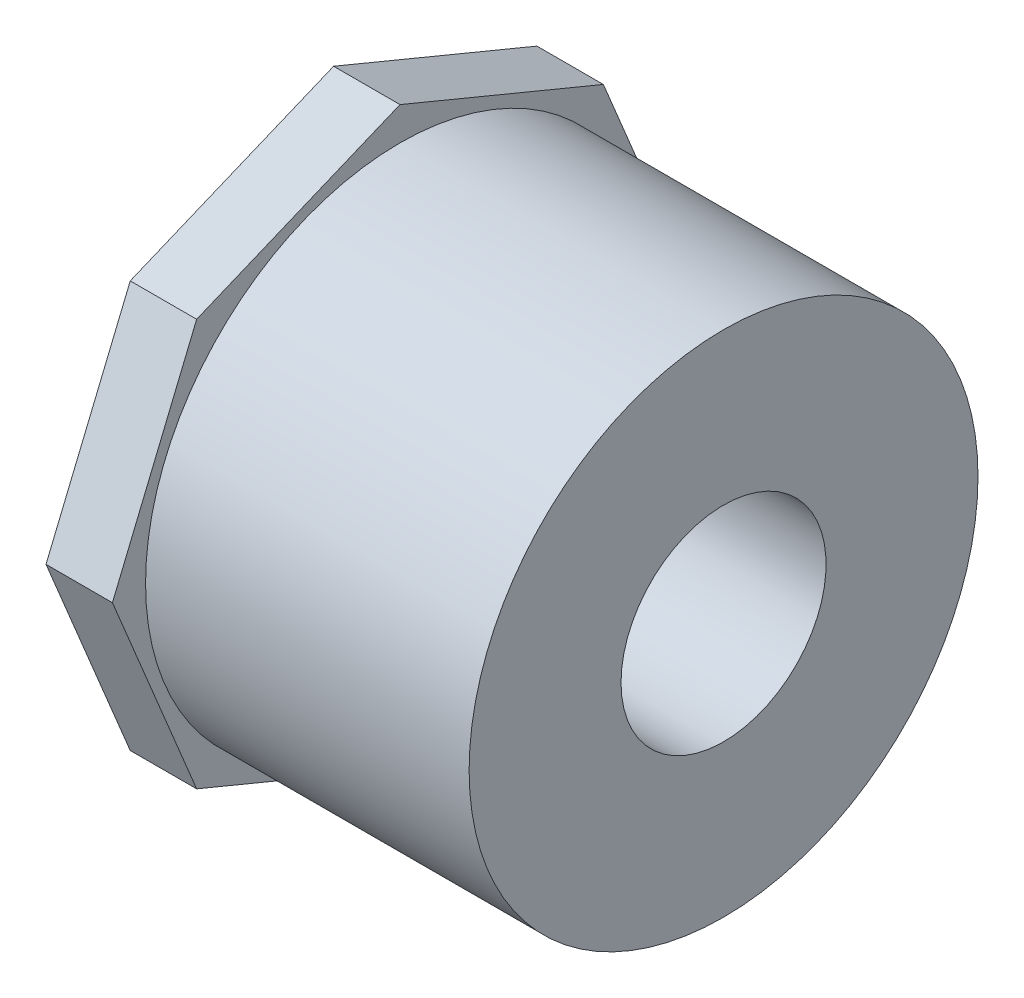
ISO-10303-21;
HEADER;
FILE_DESCRIPTION(('STEP AP214'),'2;1');
FILE_NAME('part.step','',(''),(''),'','','');
FILE_SCHEMA(('AUTOMOTIVE_DESIGN { 1 0 10303 214 1 1 1 1 }'));
ENDSEC;
DATA;
#1=APPLICATION_CONTEXT('core data for automotive mechanical design processes');
#2=APPLICATION_PROTOCOL_DEFINITION('international standard','automotive_design',2000,#1);
#3=PRODUCT_CONTEXT('',#1,'mechanical');
#4=PRODUCT('Part','Part','',(#3));
#5=PRODUCT_RELATED_PRODUCT_CATEGORY('part','',(#4));
#6=PRODUCT_DEFINITION_FORMATION('','',#4);
#7=PRODUCT_DEFINITION_CONTEXT('part definition',#1,'design');
#8=PRODUCT_DEFINITION('design','',#6,#7);
#9=PRODUCT_DEFINITION_SHAPE('','',#8);
#10=(LENGTH_UNIT() NAMED_UNIT(*) SI_UNIT(.MILLI.,.METRE.));
#11=(NAMED_UNIT(*) PLANE_ANGLE_UNIT() SI_UNIT($,.RADIAN.));
#12=(NAMED_UNIT(*) SI_UNIT($,.STERADIAN.) SOLID_ANGLE_UNIT());
#13=UNCERTAINTY_MEASURE_WITH_UNIT(LENGTH_MEASURE(1.E-05),#10,'distance_accuracy_value','');
#14=(GEOMETRIC_REPRESENTATION_CONTEXT(3) GLOBAL_UNCERTAINTY_ASSIGNED_CONTEXT((#13)) GLOBAL_UNIT_ASSIGNED_CONTEXT((#10,
#11,#12)) REPRESENTATION_CONTEXT('',''));
#15=CARTESIAN_POINT('',(0.,0.,0.));
#16=DIRECTION('',(0.,0.,1.));
#17=DIRECTION('',(1.,0.,0.));
#18=AXIS2_PLACEMENT_3D('',#15,#16,#17);
#19=CARTESIAN_POINT('',(-46.228,0.,0.));
#20=DIRECTION('',(-1.,0.,0.));
#21=DIRECTION('',(0.,0.,1.));
#22=AXIS2_PLACEMENT_3D('',#19,#20,#21);
#23=CYLINDRICAL_SURFACE('',#22,30.1625);
#24=CARTESIAN_POINT('',(0.,0.,0.));
#25=DIRECTION('',(-1.,0.,0.));
#26=DIRECTION('',(0.,0.,1.));
#27=AXIS2_PLACEMENT_3D('',#24,#25,#26);
#28=CIRCLE('',#27,30.1625);
#29=CARTESIAN_POINT('',(0.,0.,30.1625));
#30=VERTEX_POINT('',#29);
#31=EDGE_CURVE('E167',#30,#30,#28,.T.);
#32=ORIENTED_EDGE('',*,*,#31,.T.);
#33=EDGE_LOOP('',(#32));
#34=FACE_BOUND('',#33,.T.);
#35=CARTESIAN_POINT('',(-38.354,0.,0.));
#36=DIRECTION('',(-1.,0.,0.));
#37=DIRECTION('',(0.,0.,1.));
#38=AXIS2_PLACEMENT_3D('',#35,#36,#37);
#39=CIRCLE('',#38,30.1625);
#40=CARTESIAN_POINT('',(-38.354,0.,30.1625));
#41=VERTEX_POINT('',#40);
#42=EDGE_CURVE('E38',#41,#41,#39,.F.);
#43=ORIENTED_EDGE('',*,*,#42,.T.);
#44=EDGE_LOOP('',(#43));
#45=FACE_BOUND('',#44,.T.);
#46=ADVANCED_FACE('F34',(#34,#45),#23,.T.);
#47=CARTESIAN_POINT('',(-46.228,-30.1625,0.));
#48=DIRECTION('',(-1.,0.,0.));
#49=DIRECTION('',(0.,0.,1.));
#50=AXIS2_PLACEMENT_3D('',#47,#48,#49);
#51=PLANE('',#50);
#52=CARTESIAN_POINT('',(-46.228,0.,0.));
#53=DIRECTION('',(-1.,0.,0.));
#54=DIRECTION('',(0.,0.,1.));
#55=AXIS2_PLACEMENT_3D('',#52,#53,#54);
#56=CIRCLE('',#55,16.8275);
#57=CARTESIAN_POINT('',(-46.228,0.,16.8275));
#58=VERTEX_POINT('',#57);
#59=EDGE_CURVE('E11',#58,#58,#56,.T.);
#60=ORIENTED_EDGE('',*,*,#59,.F.);
#61=EDGE_LOOP('',(#60));
#62=FACE_BOUND('',#61,.T.);
#63=DIRECTION('',(0.,0.38268343236509,-0.923879532511287));
#64=VECTOR('',#63,1.);
#65=CARTESIAN_POINT('',(-46.228,24.1059947715417,24.1059947715417));
#66=LINE('',#65,#64);
#67=CARTESIAN_POINT('',(-46.228,24.1059947715417,24.1059947715417));
#68=VERTEX_POINT('',#67);
#69=CARTESIAN_POINT('',(-46.228,34.0910247404092,0.));
#70=VERTEX_POINT('',#69);
#71=EDGE_CURVE('E135',#68,#70,#66,.T.);
#72=ORIENTED_EDGE('',*,*,#71,.T.);
#73=DIRECTION('',(0.,-0.38268343236509,-0.923879532511287));
#74=VECTOR('',#73,1.);
#75=CARTESIAN_POINT('',(-46.228,34.0910247404092,0.));
#76=LINE('',#75,#74);
#77=CARTESIAN_POINT('',(-46.228,24.1059947715417,-24.1059947715417));
#78=VERTEX_POINT('',#77);
#79=EDGE_CURVE('E138',#70,#78,#76,.T.);
#80=ORIENTED_EDGE('',*,*,#79,.T.);
#81=DIRECTION('',(0.,-0.923879532511287,-0.38268343236509));
#82=VECTOR('',#81,1.);
#83=CARTESIAN_POINT('',(-46.228,24.1059947715417,-24.1059947715417));
#84=LINE('',#83,#82);
#85=CARTESIAN_POINT('',(-46.228,0.,-34.0910247404092));
#86=VERTEX_POINT('',#85);
#87=EDGE_CURVE('E141',#78,#86,#84,.T.);
#88=ORIENTED_EDGE('',*,*,#87,.T.);
#89=DIRECTION('',(0.,-0.923879532511287,0.382683432365089));
#90=VECTOR('',#89,1.);
#91=CARTESIAN_POINT('',(-46.228,0.,-34.0910247404092));
#92=LINE('',#91,#90);
#93=CARTESIAN_POINT('',(-46.228,-24.1059947715417,-24.1059947715417));
#94=VERTEX_POINT('',#93);
#95=EDGE_CURVE('E144',#86,#94,#92,.T.);
#96=ORIENTED_EDGE('',*,*,#95,.T.);
#97=DIRECTION('',(0.,-0.38268343236509,0.923879532511287));
#98=VECTOR('',#97,1.);
#99=CARTESIAN_POINT('',(-46.228,-24.1059947715417,-24.1059947715417));
#100=LINE('',#99,#98);
#101=CARTESIAN_POINT('',(-46.228,-34.0910247404092,0.));
#102=VERTEX_POINT('',#101);
#103=EDGE_CURVE('E147',#94,#102,#100,.T.);
#104=ORIENTED_EDGE('',*,*,#103,.T.);
#105=DIRECTION('',(0.,0.38268343236509,0.923879532511287));
#106=VECTOR('',#105,1.);
#107=CARTESIAN_POINT('',(-46.228,-34.0910247404092,0.));
#108=LINE('',#107,#106);
#109=CARTESIAN_POINT('',(-46.228,-24.1059947715417,24.1059947715417));
#110=VERTEX_POINT('',#109);
#111=EDGE_CURVE('E150',#102,#110,#108,.T.);
#112=ORIENTED_EDGE('',*,*,#111,.T.);
#113=DIRECTION('',(0.,0.923879532511287,0.38268343236509));
#114=VECTOR('',#113,1.);
#115=CARTESIAN_POINT('',(-46.228,-24.1059947715417,24.1059947715417));
#116=LINE('',#115,#114);
#117=CARTESIAN_POINT('',(-46.228,0.,34.0910247404092));
#118=VERTEX_POINT('',#117);
#119=EDGE_CURVE('E112',#110,#118,#116,.T.);
#120=ORIENTED_EDGE('',*,*,#119,.T.);
#121=DIRECTION('',(0.,0.923879532511287,-0.38268343236509));
#122=VECTOR('',#121,1.);
#123=CARTESIAN_POINT('',(-46.228,0.,34.0910247404092));
#124=LINE('',#123,#122);
#125=EDGE_CURVE('E153',#118,#68,#124,.T.);
#126=ORIENTED_EDGE('',*,*,#125,.T.);
#127=EDGE_LOOP('',(#72,#80,#88,#96,#104,#112,#120,#126));
#128=FACE_BOUND('',#127,.T.);
#129=ADVANCED_FACE('F36',(#62,#128),#51,.T.);
#130=CARTESIAN_POINT('',(-17.78,0.,0.));
#131=DIRECTION('',(-1.,0.,0.));
#132=DIRECTION('',(0.,0.,1.));
#133=AXIS2_PLACEMENT_3D('',#130,#131,#132);
#134=CONICAL_SURFACE('',#133,16.637,0.00669632848002419);
#135=ORIENTED_EDGE('',*,*,#59,.T.);
#136=EDGE_LOOP('',(#135));
#137=FACE_BOUND('',#136,.T.);
#138=CARTESIAN_POINT('',(-17.78,0.,0.));
#139=DIRECTION('',(-1.,0.,0.));
#140=DIRECTION('',(0.,0.,1.));
#141=AXIS2_PLACEMENT_3D('',#138,#139,#140);
#142=CIRCLE('',#141,16.637);
#143=CARTESIAN_POINT('',(-17.78,0.,16.637));
#144=VERTEX_POINT('',#143);
#145=EDGE_CURVE('E44',#144,#144,#142,.T.);
#146=ORIENTED_EDGE('',*,*,#145,.F.);
#147=EDGE_LOOP('',(#146));
#148=FACE_BOUND('',#147,.T.);
#149=ADVANCED_FACE('F182',(#137,#148),#134,.F.);
#150=CARTESIAN_POINT('',(-17.78,-12.1539,0.));
#151=DIRECTION('',(-1.,0.,0.));
#152=DIRECTION('',(0.,0.,1.));
#153=AXIS2_PLACEMENT_3D('',#150,#151,#152);
#154=PLANE('',#153);
#155=ORIENTED_EDGE('',*,*,#145,.T.);
#156=EDGE_LOOP('',(#155));
#157=FACE_BOUND('',#156,.T.);
#158=CARTESIAN_POINT('',(-17.78,0.,0.));
#159=DIRECTION('',(-1.,0.,0.));
#160=DIRECTION('',(0.,0.,1.));
#161=AXIS2_PLACEMENT_3D('',#158,#159,#160);
#162=CIRCLE('',#161,12.1539);
#163=CARTESIAN_POINT('',(-17.78,0.,12.1539));
#164=VERTEX_POINT('',#163);
#165=EDGE_CURVE('E173',#164,#164,#162,.T.);
#166=ORIENTED_EDGE('',*,*,#165,.F.);
#167=EDGE_LOOP('',(#166));
#168=FACE_BOUND('',#167,.T.);
#169=ADVANCED_FACE('F179',(#157,#168),#154,.T.);
#170=CARTESIAN_POINT('',(-46.228,0.,0.));
#171=DIRECTION('',(-1.,0.,0.));
#172=DIRECTION('',(0.,0.,1.));
#173=AXIS2_PLACEMENT_3D('',#170,#171,#172);
#174=CYLINDRICAL_SURFACE('',#173,12.1539);
#175=ORIENTED_EDGE('',*,*,#165,.T.);
#176=EDGE_LOOP('',(#175));
#177=FACE_BOUND('',#176,.T.);
#178=CARTESIAN_POINT('',(0.,0.,0.));
#179=DIRECTION('',(-1.,0.,0.));
#180=DIRECTION('',(0.,0.,1.));
#181=AXIS2_PLACEMENT_3D('',#178,#179,#180);
#182=CIRCLE('',#181,12.1539);
#183=CARTESIAN_POINT('',(0.,0.,12.1539));
#184=VERTEX_POINT('',#183);
#185=EDGE_CURVE('E170',#184,#184,#182,.T.);
#186=ORIENTED_EDGE('',*,*,#185,.F.);
#187=EDGE_LOOP('',(#186));
#188=FACE_BOUND('',#187,.T.);
#189=ADVANCED_FACE('F189',(#177,#188),#174,.F.);
#190=CARTESIAN_POINT('',(0.,-12.1539,0.));
#191=DIRECTION('',(1.,0.,0.));
#192=DIRECTION('',(0.,0.,-1.));
#193=AXIS2_PLACEMENT_3D('',#190,#191,#192);
#194=PLANE('',#193);
#195=ORIENTED_EDGE('',*,*,#185,.T.);
#196=EDGE_LOOP('',(#195));
#197=FACE_BOUND('',#196,.T.);
#198=ORIENTED_EDGE('',*,*,#31,.F.);
#199=EDGE_LOOP('',(#198));
#200=FACE_BOUND('',#199,.T.);
#201=ADVANCED_FACE('F202',(#197,#200),#194,.T.);
#202=CARTESIAN_POINT('',(-38.354,24.1059947715417,24.1059947715417));
#203=DIRECTION('',(0.,0.923879532511287,0.38268343236509));
#204=DIRECTION('',(0.,-0.38268343236509,0.923879532511287));
#205=AXIS2_PLACEMENT_3D('',#202,#203,#204);
#206=PLANE('',#205);
#207=ORIENTED_EDGE('',*,*,#71,.F.);
#208=DIRECTION('',(-1.,0.,0.));
#209=VECTOR('',#208,1.);
#210=CARTESIAN_POINT('',(-38.354,24.1059947715417,24.1059947715417));
#211=LINE('',#210,#209);
#212=CARTESIAN_POINT('',(-38.354,24.1059947715417,24.1059947715417));
#213=VERTEX_POINT('',#212);
#214=EDGE_CURVE('E52',#213,#68,#211,.T.);
#215=ORIENTED_EDGE('',*,*,#214,.F.);
#216=DIRECTION('',(0.,0.38268343236509,-0.923879532511287));
#217=VECTOR('',#216,1.);
#218=CARTESIAN_POINT('',(-38.354,24.1059947715417,24.1059947715417));
#219=LINE('',#218,#217);
#220=CARTESIAN_POINT('',(-38.354,34.0910247404092,0.));
#221=VERTEX_POINT('',#220);
#222=EDGE_CURVE('E156',#213,#221,#219,.T.);
#223=ORIENTED_EDGE('',*,*,#222,.T.);
#224=DIRECTION('',(-1.,0.,0.));
#225=VECTOR('',#224,1.);
#226=CARTESIAN_POINT('',(-38.354,34.0910247404092,0.));
#227=LINE('',#226,#225);
#228=EDGE_CURVE('E93',#221,#70,#227,.T.);
#229=ORIENTED_EDGE('',*,*,#228,.T.);
#230=EDGE_LOOP('',(#207,#215,#223,#229));
#231=FACE_BOUND('',#230,.T.);
#232=ADVANCED_FACE('F200',(#231),#206,.T.);
#233=CARTESIAN_POINT('',(-38.354,0.,34.0910247404092));
#234=DIRECTION('',(0.,0.38268343236509,0.923879532511287));
#235=DIRECTION('',(0.,-0.923879532511287,0.38268343236509));
#236=AXIS2_PLACEMENT_3D('',#233,#234,#235);
#237=PLANE('',#236);
#238=ORIENTED_EDGE('',*,*,#125,.F.);
#239=DIRECTION('',(-1.,0.,0.));
#240=VECTOR('',#239,1.);
#241=CARTESIAN_POINT('',(-38.354,0.,34.0910247404092));
#242=LINE('',#241,#240);
#243=CARTESIAN_POINT('',(-38.354,0.,34.0910247404092));
#244=VERTEX_POINT('',#243);
#245=EDGE_CURVE('E81',#244,#118,#242,.T.);
#246=ORIENTED_EDGE('',*,*,#245,.F.);
#247=DIRECTION('',(0.,0.923879532511287,-0.38268343236509));
#248=VECTOR('',#247,1.);
#249=CARTESIAN_POINT('',(-38.354,0.,34.0910247404092));
#250=LINE('',#249,#248);
#251=EDGE_CURVE('E125',#244,#213,#250,.T.);
#252=ORIENTED_EDGE('',*,*,#251,.T.);
#253=ORIENTED_EDGE('',*,*,#214,.T.);
#254=EDGE_LOOP('',(#238,#246,#252,#253));
#255=FACE_BOUND('',#254,.T.);
#256=ADVANCED_FACE('F227',(#255),#237,.T.);
#257=CARTESIAN_POINT('',(-38.354,-24.1059947715417,24.1059947715417));
#258=DIRECTION('',(0.,-0.38268343236509,0.923879532511287));
#259=DIRECTION('',(0.,-0.923879532511287,-0.38268343236509));
#260=AXIS2_PLACEMENT_3D('',#257,#258,#259);
#261=PLANE('',#260);
#262=ORIENTED_EDGE('',*,*,#119,.F.);
#263=DIRECTION('',(-1.,0.,0.));
#264=VECTOR('',#263,1.);
#265=CARTESIAN_POINT('',(-38.354,-24.1059947715417,24.1059947715417));
#266=LINE('',#265,#264);
#267=CARTESIAN_POINT('',(-38.354,-24.1059947715417,24.1059947715417));
#268=VERTEX_POINT('',#267);
#269=EDGE_CURVE('E107',#268,#110,#266,.T.);
#270=ORIENTED_EDGE('',*,*,#269,.F.);
#271=DIRECTION('',(0.,0.923879532511287,0.38268343236509));
#272=VECTOR('',#271,1.);
#273=CARTESIAN_POINT('',(-38.354,-24.1059947715417,24.1059947715417));
#274=LINE('',#273,#272);
#275=EDGE_CURVE('E110',#268,#244,#274,.T.);
#276=ORIENTED_EDGE('',*,*,#275,.T.);
#277=ORIENTED_EDGE('',*,*,#245,.T.);
#278=EDGE_LOOP('',(#262,#270,#276,#277));
#279=FACE_BOUND('',#278,.T.);
#280=ADVANCED_FACE('F109',(#279),#261,.T.);
#281=CARTESIAN_POINT('',(-38.354,-34.0910247404092,0.));
#282=DIRECTION('',(0.,-0.923879532511287,0.38268343236509));
#283=DIRECTION('',(0.,-0.38268343236509,-0.923879532511287));
#284=AXIS2_PLACEMENT_3D('',#281,#282,#283);
#285=PLANE('',#284);
#286=ORIENTED_EDGE('',*,*,#111,.F.);
#287=DIRECTION('',(-1.,0.,0.));
#288=VECTOR('',#287,1.);
#289=CARTESIAN_POINT('',(-38.354,-34.0910247404092,0.));
#290=LINE('',#289,#288);
#291=CARTESIAN_POINT('',(-38.354,-34.0910247404092,0.));
#292=VERTEX_POINT('',#291);
#293=EDGE_CURVE('E117',#292,#102,#290,.T.);
#294=ORIENTED_EDGE('',*,*,#293,.F.);
#295=DIRECTION('',(0.,0.38268343236509,0.923879532511287));
#296=VECTOR('',#295,1.);
#297=CARTESIAN_POINT('',(-38.354,-34.0910247404092,0.));
#298=LINE('',#297,#296);
#299=EDGE_CURVE('E123',#292,#268,#298,.T.);
#300=ORIENTED_EDGE('',*,*,#299,.T.);
#301=ORIENTED_EDGE('',*,*,#269,.T.);
#302=EDGE_LOOP('',(#286,#294,#300,#301));
#303=FACE_BOUND('',#302,.T.);
#304=ADVANCED_FACE('F127',(#303),#285,.T.);
#305=CARTESIAN_POINT('',(-38.354,-24.1059947715417,-24.1059947715417));
#306=DIRECTION('',(0.,-0.923879532511287,-0.38268343236509));
#307=DIRECTION('',(0.,0.38268343236509,-0.923879532511287));
#308=AXIS2_PLACEMENT_3D('',#305,#306,#307);
#309=PLANE('',#308);
#310=ORIENTED_EDGE('',*,*,#103,.F.);
#311=DIRECTION('',(-1.,0.,0.));
#312=VECTOR('',#311,1.);
#313=CARTESIAN_POINT('',(-38.354,-24.1059947715417,-24.1059947715417));
#314=LINE('',#313,#312);
#315=CARTESIAN_POINT('',(-38.354,-24.1059947715417,-24.1059947715417));
#316=VERTEX_POINT('',#315);
#317=EDGE_CURVE('E160',#316,#94,#314,.T.);
#318=ORIENTED_EDGE('',*,*,#317,.F.);
#319=DIRECTION('',(0.,-0.38268343236509,0.923879532511287));
#320=VECTOR('',#319,1.);
#321=CARTESIAN_POINT('',(-38.354,-24.1059947715417,-24.1059947715417));
#322=LINE('',#321,#320);
#323=EDGE_CURVE('E128',#316,#292,#322,.T.);
#324=ORIENTED_EDGE('',*,*,#323,.T.);
#325=ORIENTED_EDGE('',*,*,#293,.T.);
#326=EDGE_LOOP('',(#310,#318,#324,#325));
#327=FACE_BOUND('',#326,.T.);
#328=ADVANCED_FACE('F246',(#327),#309,.T.);
#329=CARTESIAN_POINT('',(-38.354,0.,-34.0910247404092));
#330=DIRECTION('',(0.,-0.38268343236509,-0.923879532511287));
#331=DIRECTION('',(0.,0.923879532511287,-0.38268343236509));
#332=AXIS2_PLACEMENT_3D('',#329,#330,#331);
#333=PLANE('',#332);
#334=ORIENTED_EDGE('',*,*,#95,.F.);
#335=DIRECTION('',(-1.,0.,0.));
#336=VECTOR('',#335,1.);
#337=CARTESIAN_POINT('',(-38.354,0.,-34.0910247404092));
#338=LINE('',#337,#336);
#339=CARTESIAN_POINT('',(-38.354,0.,-34.0910247404092));
#340=VERTEX_POINT('',#339);
#341=EDGE_CURVE('E162',#340,#86,#338,.T.);
#342=ORIENTED_EDGE('',*,*,#341,.F.);
#343=DIRECTION('',(0.,-0.923879532511287,0.382683432365089));
#344=VECTOR('',#343,1.);
#345=CARTESIAN_POINT('',(-38.354,0.,-34.0910247404092));
#346=LINE('',#345,#344);
#347=EDGE_CURVE('E130',#340,#316,#346,.T.);
#348=ORIENTED_EDGE('',*,*,#347,.T.);
#349=ORIENTED_EDGE('',*,*,#317,.T.);
#350=EDGE_LOOP('',(#334,#342,#348,#349));
#351=FACE_BOUND('',#350,.T.);
#352=ADVANCED_FACE('F253',(#351),#333,.T.);
#353=CARTESIAN_POINT('',(-38.354,24.1059947715417,-24.1059947715417));
#354=DIRECTION('',(0.,0.38268343236509,-0.923879532511287));
#355=DIRECTION('',(0.,0.923879532511287,0.38268343236509));
#356=AXIS2_PLACEMENT_3D('',#353,#354,#355);
#357=PLANE('',#356);
#358=ORIENTED_EDGE('',*,*,#87,.F.);
#359=DIRECTION('',(-1.,0.,0.));
#360=VECTOR('',#359,1.);
#361=CARTESIAN_POINT('',(-38.354,24.1059947715417,-24.1059947715417));
#362=LINE('',#361,#360);
#363=CARTESIAN_POINT('',(-38.354,24.1059947715417,-24.1059947715417));
#364=VERTEX_POINT('',#363);
#365=EDGE_CURVE('E164',#364,#78,#362,.T.);
#366=ORIENTED_EDGE('',*,*,#365,.F.);
#367=DIRECTION('',(0.,-0.923879532511287,-0.38268343236509));
#368=VECTOR('',#367,1.);
#369=CARTESIAN_POINT('',(-38.354,24.1059947715417,-24.1059947715417));
#370=LINE('',#369,#368);
#371=EDGE_CURVE('E333',#364,#340,#370,.T.);
#372=ORIENTED_EDGE('',*,*,#371,.T.);
#373=ORIENTED_EDGE('',*,*,#341,.T.);
#374=EDGE_LOOP('',(#358,#366,#372,#373));
#375=FACE_BOUND('',#374,.T.);
#376=ADVANCED_FACE('F261',(#375),#357,.T.);
#377=CARTESIAN_POINT('',(-38.354,34.0910247404092,0.));
#378=DIRECTION('',(0.,0.923879532511287,-0.38268343236509));
#379=DIRECTION('',(0.,0.38268343236509,0.923879532511287));
#380=AXIS2_PLACEMENT_3D('',#377,#378,#379);
#381=PLANE('',#380);
#382=ORIENTED_EDGE('',*,*,#79,.F.);
#383=ORIENTED_EDGE('',*,*,#228,.F.);
#384=DIRECTION('',(0.,-0.38268343236509,-0.923879532511287));
#385=VECTOR('',#384,1.);
#386=CARTESIAN_POINT('',(-38.354,34.0910247404092,0.));
#387=LINE('',#386,#385);
#388=EDGE_CURVE('E331',#221,#364,#387,.T.);
#389=ORIENTED_EDGE('',*,*,#388,.T.);
#390=ORIENTED_EDGE('',*,*,#365,.T.);
#391=EDGE_LOOP('',(#382,#383,#389,#390));
#392=FACE_BOUND('',#391,.T.);
#393=ADVANCED_FACE('F269',(#392),#381,.T.);
#394=CARTESIAN_POINT('',(-38.354,41.1515071417464,-17.0455123702046));
#395=DIRECTION('',(-1.,0.,0.));
#396=DIRECTION('',(0.,0.,1.));
#397=AXIS2_PLACEMENT_3D('',#394,#395,#396);
#398=PLANE('',#397);
#399=ORIENTED_EDGE('',*,*,#42,.F.);
#400=EDGE_LOOP('',(#399));
#401=FACE_BOUND('',#400,.T.);
#402=ORIENTED_EDGE('',*,*,#222,.F.);
#403=ORIENTED_EDGE('',*,*,#251,.F.);
#404=ORIENTED_EDGE('',*,*,#275,.F.);
#405=ORIENTED_EDGE('',*,*,#299,.F.);
#406=ORIENTED_EDGE('',*,*,#323,.F.);
#407=ORIENTED_EDGE('',*,*,#347,.F.);
#408=ORIENTED_EDGE('',*,*,#371,.F.);
#409=ORIENTED_EDGE('',*,*,#388,.F.);
#410=EDGE_LOOP('',(#402,#403,#404,#405,#406,#407,#408,#409));
#411=FACE_BOUND('',#410,.T.);
#412=ADVANCED_FACE('F121',(#401,#411),#398,.F.);
#413=CLOSED_SHELL('',(#46,#129,#149,#169,#189,#201,#232,#256,#280,#304,#328,#352,#376,#393,#412));
#414=MANIFOLD_SOLID_BREP('B2',#413);
#415=ADVANCED_BREP_SHAPE_REPRESENTATION('',(#18,#414),#14);
#416=SHAPE_DEFINITION_REPRESENTATION(#9,#415);
ENDSEC;
END-ISO-10303-21;
